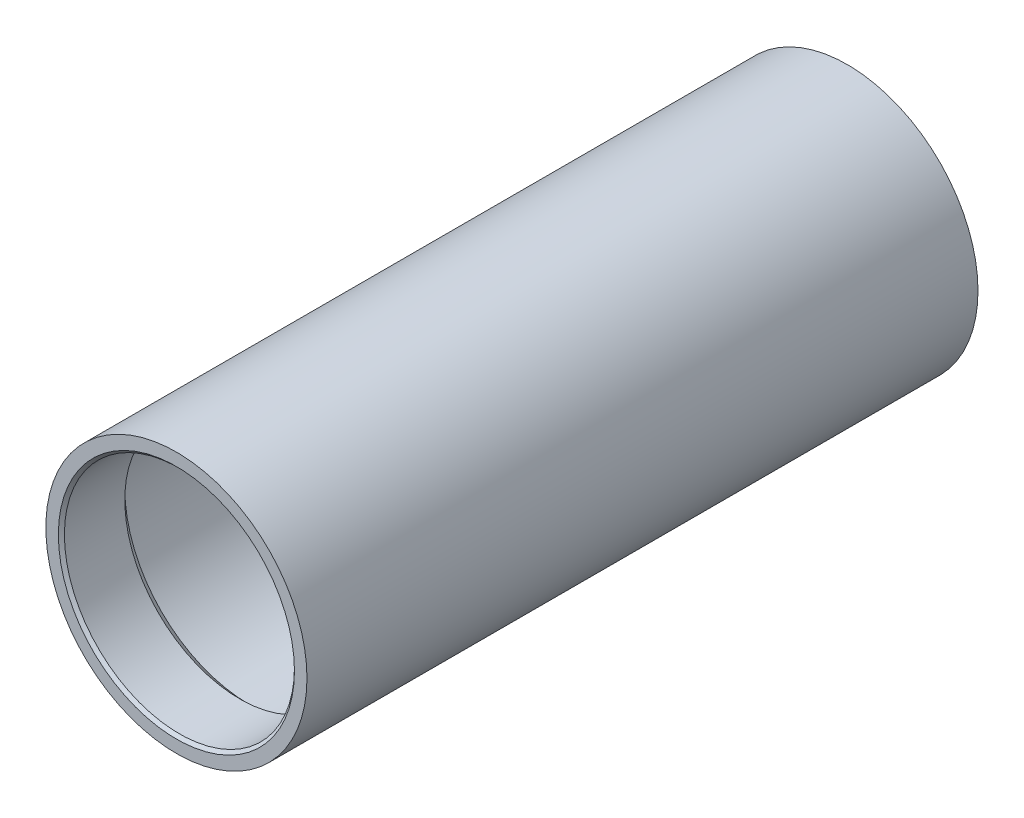
ISO-10303-21;
HEADER;
FILE_DESCRIPTION(('STEP AP214'),'2;1');
FILE_NAME('part.step','',(''),(''),'','','');
FILE_SCHEMA(('AUTOMOTIVE_DESIGN { 1 0 10303 214 1 1 1 1 }'));
ENDSEC;
DATA;
#1=APPLICATION_CONTEXT('core data for automotive mechanical design processes');
#2=APPLICATION_PROTOCOL_DEFINITION('international standard','automotive_design',2000,#1);
#3=PRODUCT_CONTEXT('',#1,'mechanical');
#4=PRODUCT('Part','Part','',(#3));
#5=PRODUCT_RELATED_PRODUCT_CATEGORY('part','',(#4));
#6=PRODUCT_DEFINITION_FORMATION('','',#4);
#7=PRODUCT_DEFINITION_CONTEXT('part definition',#1,'design');
#8=PRODUCT_DEFINITION('design','',#6,#7);
#9=PRODUCT_DEFINITION_SHAPE('','',#8);
#10=(LENGTH_UNIT() NAMED_UNIT(*) SI_UNIT(.MILLI.,.METRE.));
#11=(NAMED_UNIT(*) PLANE_ANGLE_UNIT() SI_UNIT($,.RADIAN.));
#12=(NAMED_UNIT(*) SI_UNIT($,.STERADIAN.) SOLID_ANGLE_UNIT());
#13=UNCERTAINTY_MEASURE_WITH_UNIT(LENGTH_MEASURE(1.E-05),#10,'distance_accuracy_value','');
#14=(GEOMETRIC_REPRESENTATION_CONTEXT(3) GLOBAL_UNCERTAINTY_ASSIGNED_CONTEXT((#13)) GLOBAL_UNIT_ASSIGNED_CONTEXT((#10,
#11,#12)) REPRESENTATION_CONTEXT('',''));
#15=CARTESIAN_POINT('',(0.,0.,0.));
#16=DIRECTION('',(0.,0.,1.));
#17=DIRECTION('',(1.,0.,0.));
#18=AXIS2_PLACEMENT_3D('',#15,#16,#17);
#19=CARTESIAN_POINT('',(0.,43.2435,0.));
#20=DIRECTION('',(0.,0.,-1.));
#21=DIRECTION('',(-1.,0.,0.));
#22=AXIS2_PLACEMENT_3D('',#19,#20,#21);
#23=PLANE('',#22);
#24=CARTESIAN_POINT('',(0.,0.,0.));
#25=DIRECTION('',(0.,0.,-1.));
#26=DIRECTION('',(-1.,0.,0.));
#27=AXIS2_PLACEMENT_3D('',#24,#25,#26);
#28=CIRCLE('',#27,39.1);
#29=CARTESIAN_POINT('',(-39.1,0.,0.));
#30=VERTEX_POINT('',#29);
#31=EDGE_CURVE('E50',#30,#30,#28,.T.);
#32=ORIENTED_EDGE('',*,*,#31,.T.);
#33=EDGE_LOOP('',(#32));
#34=FACE_BOUND('',#33,.T.);
#35=CARTESIAN_POINT('',(0.,0.,0.));
#36=DIRECTION('',(0.,0.,1.));
#37=DIRECTION('',(1.,0.,0.));
#38=AXIS2_PLACEMENT_3D('',#35,#36,#37);
#39=CIRCLE('',#38,43.2435);
#40=CARTESIAN_POINT('',(43.2435,0.,0.));
#41=VERTEX_POINT('',#40);
#42=EDGE_CURVE('E86',#41,#41,#39,.T.);
#43=ORIENTED_EDGE('',*,*,#42,.T.);
#44=EDGE_LOOP('',(#43));
#45=FACE_BOUND('',#44,.T.);
#46=ADVANCED_FACE('F39',(#34,#45),#23,.F.);
#47=CARTESIAN_POINT('',(0.,0.,0.));
#48=DIRECTION('',(0.,0.,1.));
#49=DIRECTION('',(1.,0.,0.));
#50=AXIS2_PLACEMENT_3D('',#47,#48,#49);
#51=CYLINDRICAL_SURFACE('',#50,38.1);
#52=CARTESIAN_POINT('',(0.,0.,-0.999999999999994));
#53=DIRECTION('',(0.,0.,-1.));
#54=DIRECTION('',(-1.,0.,0.));
#55=AXIS2_PLACEMENT_3D('',#52,#53,#54);
#56=CIRCLE('',#55,38.1);
#57=CARTESIAN_POINT('',(-38.1,0.,-0.999999999999994));
#58=VERTEX_POINT('',#57);
#59=EDGE_CURVE('E54',#58,#58,#56,.F.);
#60=ORIENTED_EDGE('',*,*,#59,.T.);
#61=EDGE_LOOP('',(#60));
#62=FACE_BOUND('',#61,.T.);
#63=CARTESIAN_POINT('',(0.,0.,-21.));
#64=DIRECTION('',(0.,0.,1.));
#65=DIRECTION('',(1.,0.,0.));
#66=AXIS2_PLACEMENT_3D('',#63,#64,#65);
#67=CIRCLE('',#66,38.1);
#68=CARTESIAN_POINT('',(38.1,0.,-21.));
#69=VERTEX_POINT('',#68);
#70=EDGE_CURVE('E59',#69,#69,#67,.T.);
#71=ORIENTED_EDGE('',*,*,#70,.F.);
#72=EDGE_LOOP('',(#71));
#73=FACE_BOUND('',#72,.T.);
#74=ADVANCED_FACE('F108',(#62,#73),#51,.F.);
#75=CARTESIAN_POINT('',(0.,0.,-21.));
#76=DIRECTION('',(0.,0.,-1.));
#77=DIRECTION('',(-1.,0.,0.));
#78=AXIS2_PLACEMENT_3D('',#75,#76,#77);
#79=CONICAL_SURFACE('',#78,38.1,0.78539816339745);
#80=CARTESIAN_POINT('',(0.,0.,-24.2385));
#81=DIRECTION('',(0.,0.,1.));
#82=DIRECTION('',(1.,0.,0.));
#83=AXIS2_PLACEMENT_3D('',#80,#81,#82);
#84=CIRCLE('',#83,41.3385);
#85=CARTESIAN_POINT('',(41.3385,0.,-24.2385));
#86=VERTEX_POINT('',#85);
#87=EDGE_CURVE('E62',#86,#86,#84,.T.);
#88=ORIENTED_EDGE('',*,*,#87,.F.);
#89=EDGE_LOOP('',(#88));
#90=FACE_BOUND('',#89,.T.);
#91=ORIENTED_EDGE('',*,*,#70,.T.);
#92=EDGE_LOOP('',(#91));
#93=FACE_BOUND('',#92,.T.);
#94=ADVANCED_FACE('F114',(#90,#93),#79,.F.);
#95=CARTESIAN_POINT('',(0.,0.,0.));
#96=DIRECTION('',(0.,0.,1.));
#97=DIRECTION('',(1.,0.,0.));
#98=AXIS2_PLACEMENT_3D('',#95,#96,#97);
#99=CYLINDRICAL_SURFACE('',#98,41.3385);
#100=CARTESIAN_POINT('',(0.,0.,-106.7865));
#101=DIRECTION('',(0.,0.,1.));
#102=DIRECTION('',(1.,0.,0.));
#103=AXIS2_PLACEMENT_3D('',#100,#101,#102);
#104=CIRCLE('',#103,41.3385);
#105=CARTESIAN_POINT('',(41.3385,0.,-106.7865));
#106=VERTEX_POINT('',#105);
#107=EDGE_CURVE('E65',#106,#106,#104,.T.);
#108=ORIENTED_EDGE('',*,*,#107,.F.);
#109=EDGE_LOOP('',(#108));
#110=FACE_BOUND('',#109,.T.);
#111=ORIENTED_EDGE('',*,*,#87,.T.);
#112=EDGE_LOOP('',(#111));
#113=FACE_BOUND('',#112,.T.);
#114=ADVANCED_FACE('F131',(#110,#113),#99,.F.);
#115=CARTESIAN_POINT('',(0.,0.,-106.7865));
#116=DIRECTION('',(0.,0.,1.));
#117=DIRECTION('',(1.,0.,0.));
#118=AXIS2_PLACEMENT_3D('',#115,#116,#117);
#119=CONICAL_SURFACE('',#118,41.3385,0.785398163397446);
#120=CARTESIAN_POINT('',(0.,0.,-108.625));
#121=DIRECTION('',(0.,0.,1.));
#122=DIRECTION('',(1.,0.,0.));
#123=AXIS2_PLACEMENT_3D('',#120,#121,#122);
#124=CIRCLE('',#123,39.5);
#125=CARTESIAN_POINT('',(39.5,0.,-108.625));
#126=VERTEX_POINT('',#125);
#127=EDGE_CURVE('E68',#126,#126,#124,.T.);
#128=ORIENTED_EDGE('',*,*,#127,.F.);
#129=EDGE_LOOP('',(#128));
#130=FACE_BOUND('',#129,.T.);
#131=ORIENTED_EDGE('',*,*,#107,.T.);
#132=EDGE_LOOP('',(#131));
#133=FACE_BOUND('',#132,.T.);
#134=ADVANCED_FACE('F136',(#130,#133),#119,.F.);
#135=CARTESIAN_POINT('',(0.,0.,0.));
#136=DIRECTION('',(0.,0.,1.));
#137=DIRECTION('',(1.,0.,0.));
#138=AXIS2_PLACEMENT_3D('',#135,#136,#137);
#139=CYLINDRICAL_SURFACE('',#138,39.5);
#140=CARTESIAN_POINT('',(0.,0.,-113.625));
#141=DIRECTION('',(0.,0.,1.));
#142=DIRECTION('',(1.,0.,0.));
#143=AXIS2_PLACEMENT_3D('',#140,#141,#142);
#144=CIRCLE('',#143,39.5);
#145=CARTESIAN_POINT('',(39.5,0.,-113.625));
#146=VERTEX_POINT('',#145);
#147=EDGE_CURVE('E71',#146,#146,#144,.T.);
#148=ORIENTED_EDGE('',*,*,#147,.F.);
#149=EDGE_LOOP('',(#148));
#150=FACE_BOUND('',#149,.T.);
#151=ORIENTED_EDGE('',*,*,#127,.T.);
#152=EDGE_LOOP('',(#151));
#153=FACE_BOUND('',#152,.T.);
#154=ADVANCED_FACE('F143',(#150,#153),#139,.F.);
#155=CARTESIAN_POINT('',(0.,0.,-113.625));
#156=DIRECTION('',(0.,0.,-1.));
#157=DIRECTION('',(-1.,0.,0.));
#158=AXIS2_PLACEMENT_3D('',#155,#156,#157);
#159=CONICAL_SURFACE('',#158,39.5,0.78539816339745);
#160=CARTESIAN_POINT('',(0.,0.,-115.4635));
#161=DIRECTION('',(0.,0.,1.));
#162=DIRECTION('',(1.,0.,0.));
#163=AXIS2_PLACEMENT_3D('',#160,#161,#162);
#164=CIRCLE('',#163,41.3385);
#165=CARTESIAN_POINT('',(41.3385,0.,-115.4635));
#166=VERTEX_POINT('',#165);
#167=EDGE_CURVE('E74',#166,#166,#164,.T.);
#168=ORIENTED_EDGE('',*,*,#167,.F.);
#169=EDGE_LOOP('',(#168));
#170=FACE_BOUND('',#169,.T.);
#171=ORIENTED_EDGE('',*,*,#147,.T.);
#172=EDGE_LOOP('',(#171));
#173=FACE_BOUND('',#172,.T.);
#174=ADVANCED_FACE('F147',(#170,#173),#159,.F.);
#175=CARTESIAN_POINT('',(0.,0.,0.));
#176=DIRECTION('',(0.,0.,1.));
#177=DIRECTION('',(1.,0.,0.));
#178=AXIS2_PLACEMENT_3D('',#175,#176,#177);
#179=CYLINDRICAL_SURFACE('',#178,41.3385);
#180=CARTESIAN_POINT('',(0.,0.,-198.0115));
#181=DIRECTION('',(0.,0.,1.));
#182=DIRECTION('',(1.,0.,0.));
#183=AXIS2_PLACEMENT_3D('',#180,#181,#182);
#184=CIRCLE('',#183,41.3385);
#185=CARTESIAN_POINT('',(41.3385,0.,-198.0115));
#186=VERTEX_POINT('',#185);
#187=EDGE_CURVE('E77',#186,#186,#184,.T.);
#188=ORIENTED_EDGE('',*,*,#187,.F.);
#189=EDGE_LOOP('',(#188));
#190=FACE_BOUND('',#189,.T.);
#191=ORIENTED_EDGE('',*,*,#167,.T.);
#192=EDGE_LOOP('',(#191));
#193=FACE_BOUND('',#192,.T.);
#194=ADVANCED_FACE('F151',(#190,#193),#179,.F.);
#195=CARTESIAN_POINT('',(0.,0.,-198.0115));
#196=DIRECTION('',(0.,0.,1.));
#197=DIRECTION('',(1.,0.,0.));
#198=AXIS2_PLACEMENT_3D('',#195,#196,#197);
#199=CONICAL_SURFACE('',#198,41.3385,0.785398163397447);
#200=CARTESIAN_POINT('',(0.,0.,-201.25));
#201=DIRECTION('',(0.,0.,1.));
#202=DIRECTION('',(1.,0.,0.));
#203=AXIS2_PLACEMENT_3D('',#200,#201,#202);
#204=CIRCLE('',#203,38.1);
#205=CARTESIAN_POINT('',(38.1,0.,-201.25));
#206=VERTEX_POINT('',#205);
#207=EDGE_CURVE('E80',#206,#206,#204,.T.);
#208=ORIENTED_EDGE('',*,*,#207,.F.);
#209=EDGE_LOOP('',(#208));
#210=FACE_BOUND('',#209,.T.);
#211=ORIENTED_EDGE('',*,*,#187,.T.);
#212=EDGE_LOOP('',(#211));
#213=FACE_BOUND('',#212,.T.);
#214=ADVANCED_FACE('F105',(#210,#213),#199,.F.);
#215=CARTESIAN_POINT('',(0.,0.,0.));
#216=DIRECTION('',(0.,0.,1.));
#217=DIRECTION('',(1.,0.,0.));
#218=AXIS2_PLACEMENT_3D('',#215,#216,#217);
#219=CYLINDRICAL_SURFACE('',#218,38.1);
#220=CARTESIAN_POINT('',(0.,0.,-221.25));
#221=DIRECTION('',(0.,0.,1.));
#222=DIRECTION('',(1.,0.,0.));
#223=AXIS2_PLACEMENT_3D('',#220,#221,#222);
#224=CIRCLE('',#223,38.1);
#225=CARTESIAN_POINT('',(38.1,0.,-221.25));
#226=VERTEX_POINT('',#225);
#227=EDGE_CURVE('E10',#226,#226,#224,.F.);
#228=ORIENTED_EDGE('',*,*,#227,.T.);
#229=EDGE_LOOP('',(#228));
#230=FACE_BOUND('',#229,.T.);
#231=ORIENTED_EDGE('',*,*,#207,.T.);
#232=EDGE_LOOP('',(#231));
#233=FACE_BOUND('',#232,.T.);
#234=ADVANCED_FACE('F100',(#230,#233),#219,.F.);
#235=CARTESIAN_POINT('',(0.,38.1,-222.25));
#236=DIRECTION('',(0.,0.,1.));
#237=DIRECTION('',(1.,0.,0.));
#238=AXIS2_PLACEMENT_3D('',#235,#236,#237);
#239=PLANE('',#238);
#240=CARTESIAN_POINT('',(0.,0.,-222.25));
#241=DIRECTION('',(0.,0.,1.));
#242=DIRECTION('',(1.,0.,0.));
#243=AXIS2_PLACEMENT_3D('',#240,#241,#242);
#244=CIRCLE('',#243,39.1);
#245=CARTESIAN_POINT('',(39.1,0.,-222.25));
#246=VERTEX_POINT('',#245);
#247=EDGE_CURVE('E46',#246,#246,#244,.T.);
#248=ORIENTED_EDGE('',*,*,#247,.T.);
#249=EDGE_LOOP('',(#248));
#250=FACE_BOUND('',#249,.T.);
#251=CARTESIAN_POINT('',(0.,0.,-222.25));
#252=DIRECTION('',(0.,0.,1.));
#253=DIRECTION('',(1.,0.,0.));
#254=AXIS2_PLACEMENT_3D('',#251,#252,#253);
#255=CIRCLE('',#254,43.2435);
#256=CARTESIAN_POINT('',(43.2435,0.,-222.25));
#257=VERTEX_POINT('',#256);
#258=EDGE_CURVE('E83',#257,#257,#255,.T.);
#259=ORIENTED_EDGE('',*,*,#258,.F.);
#260=EDGE_LOOP('',(#259));
#261=FACE_BOUND('',#260,.T.);
#262=ADVANCED_FACE('F95',(#250,#261),#239,.F.);
#263=CARTESIAN_POINT('',(0.,0.,0.));
#264=DIRECTION('',(0.,0.,1.));
#265=DIRECTION('',(1.,0.,0.));
#266=AXIS2_PLACEMENT_3D('',#263,#264,#265);
#267=CYLINDRICAL_SURFACE('',#266,43.2435);
#268=ORIENTED_EDGE('',*,*,#42,.F.);
#269=EDGE_LOOP('',(#268));
#270=FACE_BOUND('',#269,.T.);
#271=ORIENTED_EDGE('',*,*,#258,.T.);
#272=EDGE_LOOP('',(#271));
#273=FACE_BOUND('',#272,.T.);
#274=ADVANCED_FACE('F91',(#270,#273),#267,.T.);
#275=CARTESIAN_POINT('',(0.,0.,-0.999999999999994));
#276=DIRECTION('',(0.,0.,1.));
#277=DIRECTION('',(1.,0.,0.));
#278=AXIS2_PLACEMENT_3D('',#275,#276,#277);
#279=CONICAL_SURFACE('',#278,38.1,0.785398163397448);
#280=ORIENTED_EDGE('',*,*,#31,.F.);
#281=EDGE_LOOP('',(#280));
#282=FACE_BOUND('',#281,.T.);
#283=ORIENTED_EDGE('',*,*,#59,.F.);
#284=EDGE_LOOP('',(#283));
#285=FACE_BOUND('',#284,.T.);
#286=ADVANCED_FACE('F94',(#282,#285),#279,.F.);
#287=CARTESIAN_POINT('',(0.,0.,-222.25));
#288=DIRECTION('',(0.,0.,-1.));
#289=DIRECTION('',(-1.,0.,0.));
#290=AXIS2_PLACEMENT_3D('',#287,#288,#289);
#291=CONICAL_SURFACE('',#290,39.1,0.785398163397445);
#292=ORIENTED_EDGE('',*,*,#227,.F.);
#293=EDGE_LOOP('',(#292));
#294=FACE_BOUND('',#293,.T.);
#295=ORIENTED_EDGE('',*,*,#247,.F.);
#296=EDGE_LOOP('',(#295));
#297=FACE_BOUND('',#296,.T.);
#298=ADVANCED_FACE('F41',(#294,#297),#291,.F.);
#299=CLOSED_SHELL('',(#46,#74,#94,#114,#134,#154,#174,#194,#214,#234,#262,#274,#286,#298));
#300=MANIFOLD_SOLID_BREP('B2',#299);
#301=ADVANCED_BREP_SHAPE_REPRESENTATION('',(#18,#300),#14);
#302=SHAPE_DEFINITION_REPRESENTATION(#9,#301);
ENDSEC;
END-ISO-10303-21;
